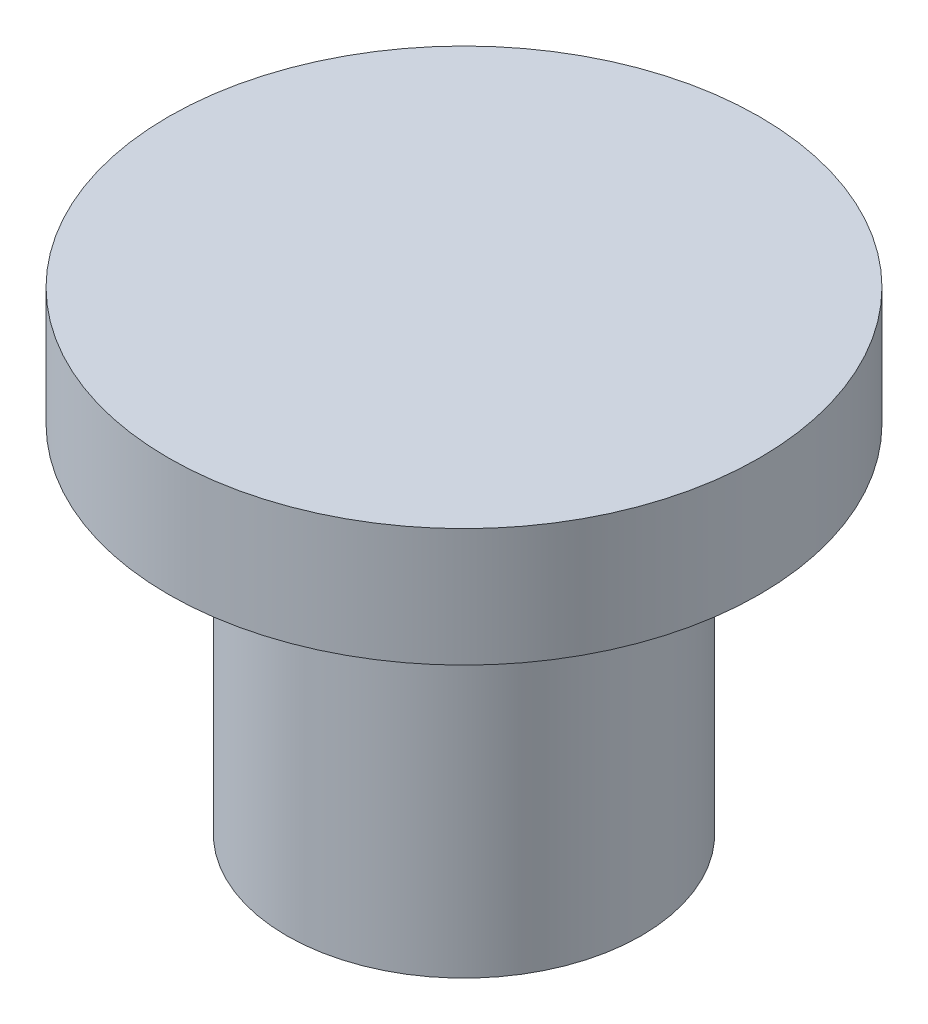
ISO-10303-21;
HEADER;
FILE_DESCRIPTION(('STEP AP214'),'2;1');
FILE_NAME('part.step','',(''),(''),'','','');
FILE_SCHEMA(('AUTOMOTIVE_DESIGN { 1 0 10303 214 1 1 1 1 }'));
ENDSEC;
DATA;
#1=APPLICATION_CONTEXT('core data for automotive mechanical design processes');
#2=APPLICATION_PROTOCOL_DEFINITION('international standard','automotive_design',2000,#1);
#3=PRODUCT_CONTEXT('',#1,'mechanical');
#4=PRODUCT('Part','Part','',(#3));
#5=PRODUCT_RELATED_PRODUCT_CATEGORY('part','',(#4));
#6=PRODUCT_DEFINITION_FORMATION('','',#4);
#7=PRODUCT_DEFINITION_CONTEXT('part definition',#1,'design');
#8=PRODUCT_DEFINITION('design','',#6,#7);
#9=PRODUCT_DEFINITION_SHAPE('','',#8);
#10=(LENGTH_UNIT() NAMED_UNIT(*) SI_UNIT(.MILLI.,.METRE.));
#11=(NAMED_UNIT(*) PLANE_ANGLE_UNIT() SI_UNIT($,.RADIAN.));
#12=(NAMED_UNIT(*) SI_UNIT($,.STERADIAN.) SOLID_ANGLE_UNIT());
#13=UNCERTAINTY_MEASURE_WITH_UNIT(LENGTH_MEASURE(1.E-05),#10,'distance_accuracy_value','');
#14=(GEOMETRIC_REPRESENTATION_CONTEXT(3) GLOBAL_UNCERTAINTY_ASSIGNED_CONTEXT((#13)) GLOBAL_UNIT_ASSIGNED_CONTEXT((#10,
#11,#12)) REPRESENTATION_CONTEXT('',''));
#15=CARTESIAN_POINT('',(0.,0.,0.));
#16=DIRECTION('',(0.,0.,1.));
#17=DIRECTION('',(1.,0.,0.));
#18=AXIS2_PLACEMENT_3D('',#15,#16,#17);
#19=CARTESIAN_POINT('',(-5.,8.,0.));
#20=DIRECTION('',(0.,1.,0.));
#21=DIRECTION('',(0.,0.,1.));
#22=AXIS2_PLACEMENT_3D('',#19,#20,#21);
#23=PLANE('',#22);
#24=CARTESIAN_POINT('',(0.,8.,0.));
#25=DIRECTION('',(0.,1.,0.));
#26=DIRECTION('',(0.,0.,1.));
#27=AXIS2_PLACEMENT_3D('',#24,#25,#26);
#28=CIRCLE('',#27,5.);
#29=CARTESIAN_POINT('',(0.,8.,5.));
#30=VERTEX_POINT('',#29);
#31=EDGE_CURVE('E45',#30,#30,#28,.T.);
#32=ORIENTED_EDGE('',*,*,#31,.T.);
#33=EDGE_LOOP('',(#32));
#34=FACE_BOUND('',#33,.T.);
#35=ADVANCED_FACE('F31',(#34),#23,.T.);
#36=CARTESIAN_POINT('',(-3.,0.,0.));
#37=DIRECTION('',(0.,-1.,0.));
#38=DIRECTION('',(0.,0.,-1.));
#39=AXIS2_PLACEMENT_3D('',#36,#37,#38);
#40=PLANE('',#39);
#41=CARTESIAN_POINT('',(0.,0.,0.));
#42=DIRECTION('',(0.,1.,0.));
#43=DIRECTION('',(0.,0.,1.));
#44=AXIS2_PLACEMENT_3D('',#41,#42,#43);
#45=CIRCLE('',#44,3.);
#46=CARTESIAN_POINT('',(0.,0.,3.));
#47=VERTEX_POINT('',#46);
#48=EDGE_CURVE('E10',#47,#47,#45,.T.);
#49=ORIENTED_EDGE('',*,*,#48,.F.);
#50=EDGE_LOOP('',(#49));
#51=FACE_BOUND('',#50,.T.);
#52=ADVANCED_FACE('F63',(#51),#40,.T.);
#53=CARTESIAN_POINT('',(0.,14.5880413471286,0.));
#54=DIRECTION('',(0.,1.,0.));
#55=DIRECTION('',(0.,0.,1.));
#56=AXIS2_PLACEMENT_3D('',#53,#54,#55);
#57=CYLINDRICAL_SURFACE('',#56,3.);
#58=ORIENTED_EDGE('',*,*,#48,.T.);
#59=EDGE_LOOP('',(#58));
#60=FACE_BOUND('',#59,.T.);
#61=CARTESIAN_POINT('',(0.,6.,0.));
#62=DIRECTION('',(0.,1.,0.));
#63=DIRECTION('',(0.,0.,1.));
#64=AXIS2_PLACEMENT_3D('',#61,#62,#63);
#65=CIRCLE('',#64,3.);
#66=CARTESIAN_POINT('',(0.,6.,3.));
#67=VERTEX_POINT('',#66);
#68=EDGE_CURVE('E37',#67,#67,#65,.T.);
#69=ORIENTED_EDGE('',*,*,#68,.F.);
#70=EDGE_LOOP('',(#69));
#71=FACE_BOUND('',#70,.T.);
#72=ADVANCED_FACE('F60',(#60,#71),#57,.T.);
#73=CARTESIAN_POINT('',(-5.,6.,0.));
#74=DIRECTION('',(0.,-1.,0.));
#75=DIRECTION('',(0.,0.,-1.));
#76=AXIS2_PLACEMENT_3D('',#73,#74,#75);
#77=PLANE('',#76);
#78=ORIENTED_EDGE('',*,*,#68,.T.);
#79=EDGE_LOOP('',(#78));
#80=FACE_BOUND('',#79,.T.);
#81=CARTESIAN_POINT('',(0.,6.,0.));
#82=DIRECTION('',(0.,1.,0.));
#83=DIRECTION('',(0.,0.,1.));
#84=AXIS2_PLACEMENT_3D('',#81,#82,#83);
#85=CIRCLE('',#84,5.);
#86=CARTESIAN_POINT('',(0.,6.,5.));
#87=VERTEX_POINT('',#86);
#88=EDGE_CURVE('E41',#87,#87,#85,.T.);
#89=ORIENTED_EDGE('',*,*,#88,.F.);
#90=EDGE_LOOP('',(#89));
#91=FACE_BOUND('',#90,.T.);
#92=ADVANCED_FACE('F54',(#80,#91),#77,.T.);
#93=CARTESIAN_POINT('',(0.,14.5880413471286,0.));
#94=DIRECTION('',(0.,1.,0.));
#95=DIRECTION('',(0.,0.,1.));
#96=AXIS2_PLACEMENT_3D('',#93,#94,#95);
#97=CYLINDRICAL_SURFACE('',#96,5.);
#98=ORIENTED_EDGE('',*,*,#88,.T.);
#99=EDGE_LOOP('',(#98));
#100=FACE_BOUND('',#99,.T.);
#101=ORIENTED_EDGE('',*,*,#31,.F.);
#102=EDGE_LOOP('',(#101));
#103=FACE_BOUND('',#102,.T.);
#104=ADVANCED_FACE('F52',(#100,#103),#97,.T.);
#105=CLOSED_SHELL('',(#35,#52,#72,#92,#104));
#106=MANIFOLD_SOLID_BREP('B2',#105);
#107=ADVANCED_BREP_SHAPE_REPRESENTATION('',(#18,#106),#14);
#108=SHAPE_DEFINITION_REPRESENTATION(#9,#107);
ENDSEC;
END-ISO-10303-21;
